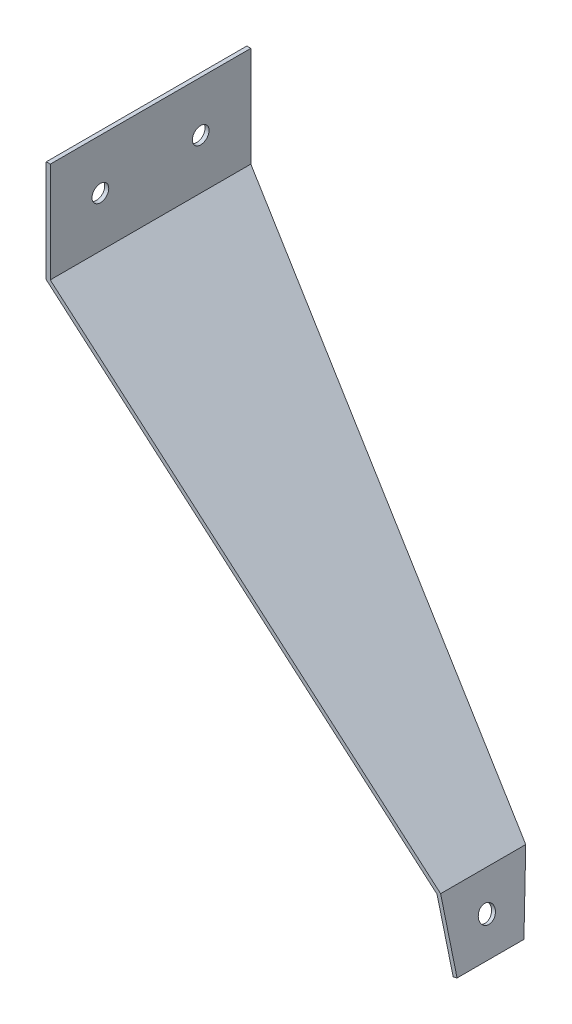
ISO-10303-21;
HEADER;
FILE_DESCRIPTION(('STEP AP214'),'2;1');
FILE_NAME('part.step','',(''),(''),'','','');
FILE_SCHEMA(('AUTOMOTIVE_DESIGN { 1 0 10303 214 1 1 1 1 }'));
ENDSEC;
DATA;
#1=APPLICATION_CONTEXT('core data for automotive mechanical design processes');
#2=APPLICATION_PROTOCOL_DEFINITION('international standard','automotive_design',2000,#1);
#3=PRODUCT_CONTEXT('',#1,'mechanical');
#4=PRODUCT('Part','Part','',(#3));
#5=PRODUCT_RELATED_PRODUCT_CATEGORY('part','',(#4));
#6=PRODUCT_DEFINITION_FORMATION('','',#4);
#7=PRODUCT_DEFINITION_CONTEXT('part definition',#1,'design');
#8=PRODUCT_DEFINITION('design','',#6,#7);
#9=PRODUCT_DEFINITION_SHAPE('','',#8);
#10=(LENGTH_UNIT() NAMED_UNIT(*) SI_UNIT(.MILLI.,.METRE.));
#11=(NAMED_UNIT(*) PLANE_ANGLE_UNIT() SI_UNIT($,.RADIAN.));
#12=(NAMED_UNIT(*) SI_UNIT($,.STERADIAN.) SOLID_ANGLE_UNIT());
#13=UNCERTAINTY_MEASURE_WITH_UNIT(LENGTH_MEASURE(1.E-05),#10,'distance_accuracy_value','');
#14=(GEOMETRIC_REPRESENTATION_CONTEXT(3) GLOBAL_UNCERTAINTY_ASSIGNED_CONTEXT((#13)) GLOBAL_UNIT_ASSIGNED_CONTEXT((#10,
#11,#12)) REPRESENTATION_CONTEXT('',''));
#15=CARTESIAN_POINT('',(0.,0.,0.));
#16=DIRECTION('',(0.,0.,1.));
#17=DIRECTION('',(1.,0.,0.));
#18=AXIS2_PLACEMENT_3D('',#15,#16,#17);
#19=CARTESIAN_POINT('',(0.,0.,-76.2));
#20=DIRECTION('',(0.652759752462726,0.757564984384047,0.));
#21=DIRECTION('',(-0.757564984384047,0.652759752462726,0.));
#22=AXIS2_PLACEMENT_3D('',#19,#20,#21);
#23=PLANE('',#22);
#24=DIRECTION('',(0.739242312652907,-0.636971928434139,0.218603672362739));
#25=VECTOR('',#24,1.);
#26=CARTESIAN_POINT('',(0.,0.,-76.2));
#27=LINE('',#26,#25);
#28=CARTESIAN_POINT('',(0.,1.14491749414469E-13,-76.2));
#29=VERTEX_POINT('',#28);
#30=CARTESIAN_POINT('',(148.297771302394,-127.781534893449,-32.346399015536));
#31=VERTEX_POINT('',#30);
#32=EDGE_CURVE('E124',#29,#31,#27,.T.);
#33=ORIENTED_EDGE('',*,*,#32,.F.);
#34=DIRECTION('',(0.,0.,1.));
#35=VECTOR('',#34,1.);
#36=CARTESIAN_POINT('',(0.,0.,-76.2));
#37=LINE('',#36,#35);
#38=CARTESIAN_POINT('',(0.,0.,0.));
#39=VERTEX_POINT('',#38);
#40=EDGE_CURVE('E118',#29,#39,#37,.T.);
#41=ORIENTED_EDGE('',*,*,#40,.T.);
#42=DIRECTION('',(-0.757564984384047,0.652759752462726,0.));
#43=VECTOR('',#42,1.);
#44=CARTESIAN_POINT('',(0.,0.,0.));
#45=LINE('',#44,#43);
#46=CARTESIAN_POINT('',(148.297771302394,-127.781534893448,0.));
#47=VERTEX_POINT('',#46);
#48=EDGE_CURVE('E116',#47,#39,#45,.T.);
#49=ORIENTED_EDGE('',*,*,#48,.F.);
#50=DIRECTION('',(0.,0.,1.));
#51=VECTOR('',#50,1.);
#52=CARTESIAN_POINT('',(148.297771302394,-127.781534893448,-76.2));
#53=LINE('',#52,#51);
#54=EDGE_CURVE('E55',#31,#47,#53,.T.);
#55=ORIENTED_EDGE('',*,*,#54,.F.);
#56=EDGE_LOOP('',(#33,#41,#49,#55));
#57=FACE_BOUND('',#56,.T.);
#58=ADVANCED_FACE('F46',(#57),#23,.T.);
#59=CARTESIAN_POINT('',(148.297771302394,-127.781534893448,-76.2));
#60=DIRECTION('',(0.969230909706754,0.246153293028995,0.));
#61=DIRECTION('',(-0.246153293028995,0.969230909706754,0.));
#62=AXIS2_PLACEMENT_3D('',#59,#60,#61);
#63=PLANE('',#62);
#64=CARTESIAN_POINT('',(151.423918123862,-140.090767446724,-14.436599753884));
#65=DIRECTION('',(0.969230909706754,0.246153293028994,0.));
#66=DIRECTION('',(-0.246153293028994,0.969230909706754,0.));
#67=AXIS2_PLACEMENT_3D('',#64,#65,#66);
#68=CIRCLE('',#67,3.175);
#69=CARTESIAN_POINT('',(150.642381418495,-137.013459308405,-14.436599753884));
#70=VERTEX_POINT('',#69);
#71=EDGE_CURVE('E157',#70,#70,#68,.T.);
#72=ORIENTED_EDGE('',*,*,#71,.F.);
#73=EDGE_LOOP('',(#72));
#74=FACE_BOUND('',#73,.T.);
#75=DIRECTION('',(0.237434348415612,-0.934899983171816,0.263793388199537));
#76=VECTOR('',#75,1.);
#77=CARTESIAN_POINT('',(154.550064945331,-152.4,-25.4));
#78=LINE('',#77,#76);
#79=CARTESIAN_POINT('',(154.550064945331,-152.4,-25.4));
#80=VERTEX_POINT('',#79);
#81=EDGE_CURVE('E109',#31,#80,#78,.T.);
#82=ORIENTED_EDGE('',*,*,#81,.F.);
#83=ORIENTED_EDGE('',*,*,#54,.T.);
#84=DIRECTION('',(-0.246153293028995,0.969230909706754,0.));
#85=VECTOR('',#84,1.);
#86=CARTESIAN_POINT('',(148.297771302394,-127.781534893448,0.));
#87=LINE('',#86,#85);
#88=CARTESIAN_POINT('',(154.550064945331,-152.4,0.));
#89=VERTEX_POINT('',#88);
#90=EDGE_CURVE('E106',#89,#47,#87,.T.);
#91=ORIENTED_EDGE('',*,*,#90,.F.);
#92=DIRECTION('',(0.,0.,1.));
#93=VECTOR('',#92,1.);
#94=CARTESIAN_POINT('',(154.550064945331,-152.4,-76.2));
#95=LINE('',#94,#93);
#96=EDGE_CURVE('E113',#80,#89,#95,.T.);
#97=ORIENTED_EDGE('',*,*,#96,.F.);
#98=EDGE_LOOP('',(#82,#83,#91,#97));
#99=FACE_BOUND('',#98,.T.);
#100=ADVANCED_FACE('F103',(#74,#99),#63,.T.);
#101=CARTESIAN_POINT('',(153.072957038938,-152.775137618576,-76.2));
#102=DIRECTION('',(0.246153293028989,-0.969230909706756,0.));
#103=DIRECTION('',(0.969230909706756,0.246153293028989,0.));
#104=AXIS2_PLACEMENT_3D('',#101,#102,#103);
#105=PLANE('',#104);
#106=DIRECTION('',(0.969230909706754,0.246153293028994,0.));
#107=VECTOR('',#106,1.);
#108=CARTESIAN_POINT('',(7.84325281382631,-189.65878379888,-25.4));
#109=LINE('',#108,#107);
#110=CARTESIAN_POINT('',(153.072957038938,-152.775137618576,-25.4));
#111=VERTEX_POINT('',#110);
#112=EDGE_CURVE('E165',#111,#80,#109,.T.);
#113=ORIENTED_EDGE('',*,*,#112,.T.);
#114=ORIENTED_EDGE('',*,*,#96,.T.);
#115=DIRECTION('',(0.969230909706755,0.246153293028988,0.));
#116=VECTOR('',#115,1.);
#117=CARTESIAN_POINT('',(153.072957038938,-152.775137618576,0.));
#118=LINE('',#117,#116);
#119=CARTESIAN_POINT('',(153.072957038938,-152.775137618576,0.));
#120=VERTEX_POINT('',#119);
#121=EDGE_CURVE('E130',#120,#89,#118,.T.);
#122=ORIENTED_EDGE('',*,*,#121,.F.);
#123=DIRECTION('',(0.,0.,1.));
#124=VECTOR('',#123,1.);
#125=CARTESIAN_POINT('',(153.072957038938,-152.775137618576,-76.2));
#126=LINE('',#125,#124);
#127=EDGE_CURVE('E209',#111,#120,#126,.T.);
#128=ORIENTED_EDGE('',*,*,#127,.F.);
#129=EDGE_LOOP('',(#113,#114,#122,#128));
#130=FACE_BOUND('',#129,.T.);
#131=ADVANCED_FACE('F213',(#130),#105,.T.);
#132=CARTESIAN_POINT('',(146.938943832801,-128.622402845954,-76.2));
#133=DIRECTION('',(-0.969230909706754,-0.246153293028994,0.));
#134=DIRECTION('',(0.246153293028994,-0.969230909706754,0.));
#135=AXIS2_PLACEMENT_3D('',#132,#133,#134);
#136=PLANE('',#135);
#137=CARTESIAN_POINT('',(149.946810217469,-140.4659050653,-14.436599753884));
#138=DIRECTION('',(-0.969230909706754,-0.246153293028994,0.));
#139=DIRECTION('',(0.246153293028994,-0.969230909706754,0.));
#140=AXIS2_PLACEMENT_3D('',#137,#138,#139);
#141=CIRCLE('',#140,3.175);
#142=CARTESIAN_POINT('',(150.728346922836,-143.543213203619,-14.436599753884));
#143=VERTEX_POINT('',#142);
#144=EDGE_CURVE('E49',#143,#143,#141,.T.);
#145=ORIENTED_EDGE('',*,*,#144,.F.);
#146=EDGE_LOOP('',(#145));
#147=FACE_BOUND('',#146,.T.);
#148=DIRECTION('',(-0.237434348415611,0.934899983171817,-0.263793388199537));
#149=VECTOR('',#148,1.);
#150=CARTESIAN_POINT('',(144.184003662075,-117.7747999762,-35.2757704791972));
#151=LINE('',#150,#149);
#152=CARTESIAN_POINT('',(146.938943832801,-128.622402845954,-32.2149875437358));
#153=VERTEX_POINT('',#152);
#154=EDGE_CURVE('E174',#111,#153,#151,.T.);
#155=ORIENTED_EDGE('',*,*,#154,.F.);
#156=ORIENTED_EDGE('',*,*,#127,.T.);
#157=DIRECTION('',(0.246153293028994,-0.969230909706754,0.));
#158=VECTOR('',#157,1.);
#159=CARTESIAN_POINT('',(146.938943832801,-128.622402845954,0.));
#160=LINE('',#159,#158);
#161=CARTESIAN_POINT('',(146.938943832801,-128.622402845954,0.));
#162=VERTEX_POINT('',#161);
#163=EDGE_CURVE('E139',#162,#120,#160,.T.);
#164=ORIENTED_EDGE('',*,*,#163,.F.);
#165=DIRECTION('',(0.,0.,1.));
#166=VECTOR('',#165,1.);
#167=CARTESIAN_POINT('',(146.938943832801,-128.622402845954,-76.2));
#168=LINE('',#167,#166);
#169=EDGE_CURVE('E207',#153,#162,#168,.T.);
#170=ORIENTED_EDGE('',*,*,#169,.F.);
#171=EDGE_LOOP('',(#155,#156,#164,#170));
#172=FACE_BOUND('',#171,.T.);
#173=ADVANCED_FACE('F206',(#147,#172),#136,.T.);
#174=CARTESIAN_POINT('',(-1.524,-0.698546194920925,-76.2));
#175=DIRECTION('',(-0.652759752462726,-0.757564984384046,0.));
#176=DIRECTION('',(0.757564984384046,-0.652759752462726,0.));
#177=AXIS2_PLACEMENT_3D('',#174,#175,#176);
#178=PLANE('',#177);
#179=DIRECTION('',(-0.739242312652907,0.636971928434139,-0.218603672362739));
#180=VECTOR('',#179,1.);
#181=CARTESIAN_POINT('',(-1.53734304320666,-0.687049093338597,-76.1213779306704));
#182=LINE('',#181,#180);
#183=CARTESIAN_POINT('',(-1.524,-0.698546194920925,-76.1174322173426));
#184=VERTEX_POINT('',#183);
#185=EDGE_CURVE('E171',#153,#184,#182,.T.);
#186=ORIENTED_EDGE('',*,*,#185,.F.);
#187=ORIENTED_EDGE('',*,*,#169,.T.);
#188=DIRECTION('',(0.757564984384046,-0.652759752462726,0.));
#189=VECTOR('',#188,1.);
#190=CARTESIAN_POINT('',(-1.524,-0.698546194920925,0.));
#191=LINE('',#190,#189);
#192=CARTESIAN_POINT('',(-1.524,-0.698546194920925,0.));
#193=VERTEX_POINT('',#192);
#194=EDGE_CURVE('E197',#193,#162,#191,.T.);
#195=ORIENTED_EDGE('',*,*,#194,.F.);
#196=DIRECTION('',(0.,0.,1.));
#197=VECTOR('',#196,1.);
#198=CARTESIAN_POINT('',(-1.524,-0.698546194920925,-76.2));
#199=LINE('',#198,#197);
#200=EDGE_CURVE('E219',#184,#193,#199,.T.);
#201=ORIENTED_EDGE('',*,*,#200,.F.);
#202=EDGE_LOOP('',(#186,#187,#195,#201));
#203=FACE_BOUND('',#202,.T.);
#204=ADVANCED_FACE('F266',(#203),#178,.T.);
#205=CARTESIAN_POINT('',(-1.524,-0.698546194920925,-76.2));
#206=DIRECTION('',(-1.,0.,0.));
#207=DIRECTION('',(0.,0.,1.));
#208=AXIS2_PLACEMENT_3D('',#205,#206,#207);
#209=PLANE('',#208);
#210=CARTESIAN_POINT('',(-1.52400000000003,19.05,-19.05));
#211=DIRECTION('',(1.,0.,0.));
#212=DIRECTION('',(0.,0.,-1.));
#213=AXIS2_PLACEMENT_3D('',#210,#211,#212);
#214=CIRCLE('',#213,3.175);
#215=CARTESIAN_POINT('',(-1.52400000000003,19.05,-22.225));
#216=VERTEX_POINT('',#215);
#217=EDGE_CURVE('E162',#216,#216,#214,.T.);
#218=ORIENTED_EDGE('',*,*,#217,.T.);
#219=EDGE_LOOP('',(#218));
#220=FACE_BOUND('',#219,.T.);
#221=CARTESIAN_POINT('',(-1.52400000000003,19.05,-57.15));
#222=DIRECTION('',(1.,0.,0.));
#223=DIRECTION('',(0.,0.,-1.));
#224=AXIS2_PLACEMENT_3D('',#221,#222,#223);
#225=CIRCLE('',#224,3.175);
#226=CARTESIAN_POINT('',(-1.52400000000003,19.05,-60.325));
#227=VERTEX_POINT('',#226);
#228=EDGE_CURVE('E155',#227,#227,#225,.T.);
#229=ORIENTED_EDGE('',*,*,#228,.T.);
#230=EDGE_LOOP('',(#229));
#231=FACE_BOUND('',#230,.T.);
#232=DIRECTION('',(0.,0.966619174412419,-0.256217430434102));
#233=VECTOR('',#232,1.);
#234=CARTESIAN_POINT('',(-1.524,-0.678097071361907,-76.1228525752577));
#235=LINE('',#234,#233);
#236=CARTESIAN_POINT('',(-1.524,-0.387046693227816,-76.2));
#237=VERTEX_POINT('',#236);
#238=EDGE_CURVE('E62',#184,#237,#235,.T.);
#239=ORIENTED_EDGE('',*,*,#238,.F.);
#240=ORIENTED_EDGE('',*,*,#200,.T.);
#241=DIRECTION('',(0.,-1.,0.));
#242=VECTOR('',#241,1.);
#243=CARTESIAN_POINT('',(-1.524,-0.698546194920925,0.));
#244=LINE('',#243,#242);
#245=CARTESIAN_POINT('',(-1.524,38.1,0.));
#246=VERTEX_POINT('',#245);
#247=EDGE_CURVE('E193',#246,#193,#244,.T.);
#248=ORIENTED_EDGE('',*,*,#247,.F.);
#249=DIRECTION('',(0.,0.,1.));
#250=VECTOR('',#249,1.);
#251=CARTESIAN_POINT('',(-1.524,38.1,-76.2));
#252=LINE('',#251,#250);
#253=CARTESIAN_POINT('',(-1.524,38.1,-76.2));
#254=VERTEX_POINT('',#253);
#255=EDGE_CURVE('E70',#254,#246,#252,.T.);
#256=ORIENTED_EDGE('',*,*,#255,.F.);
#257=DIRECTION('',(0.,-1.,0.));
#258=VECTOR('',#257,1.);
#259=CARTESIAN_POINT('',(-1.524,-0.698546194920925,-76.2));
#260=LINE('',#259,#258);
#261=EDGE_CURVE('E184',#254,#237,#260,.T.);
#262=ORIENTED_EDGE('',*,*,#261,.T.);
#263=EDGE_LOOP('',(#239,#240,#248,#256,#262));
#264=FACE_BOUND('',#263,.T.);
#265=ADVANCED_FACE('F240',(#220,#231,#264),#209,.T.);
#266=CARTESIAN_POINT('',(-1.524,38.1,-76.2));
#267=DIRECTION('',(0.,1.,0.));
#268=DIRECTION('',(0.,0.,1.));
#269=AXIS2_PLACEMENT_3D('',#266,#267,#268);
#270=PLANE('',#269);
#271=DIRECTION('',(-1.,0.,0.));
#272=VECTOR('',#271,1.);
#273=CARTESIAN_POINT('',(-1.524,38.1,0.));
#274=LINE('',#273,#272);
#275=CARTESIAN_POINT('',(0.,38.1,0.));
#276=VERTEX_POINT('',#275);
#277=EDGE_CURVE('E189',#276,#246,#274,.T.);
#278=ORIENTED_EDGE('',*,*,#277,.F.);
#279=DIRECTION('',(0.,0.,1.));
#280=VECTOR('',#279,1.);
#281=CARTESIAN_POINT('',(0.,38.1,-76.2));
#282=LINE('',#281,#280);
#283=CARTESIAN_POINT('',(0.,38.1,-76.2));
#284=VERTEX_POINT('',#283);
#285=EDGE_CURVE('E224',#284,#276,#282,.T.);
#286=ORIENTED_EDGE('',*,*,#285,.F.);
#287=DIRECTION('',(-1.,0.,0.));
#288=VECTOR('',#287,1.);
#289=CARTESIAN_POINT('',(-1.524,38.1,-76.2));
#290=LINE('',#289,#288);
#291=EDGE_CURVE('E137',#284,#254,#290,.T.);
#292=ORIENTED_EDGE('',*,*,#291,.T.);
#293=ORIENTED_EDGE('',*,*,#255,.T.);
#294=EDGE_LOOP('',(#278,#286,#292,#293));
#295=FACE_BOUND('',#294,.T.);
#296=ADVANCED_FACE('F254',(#295),#270,.T.);
#297=CARTESIAN_POINT('',(0.,0.,-76.2));
#298=DIRECTION('',(1.,0.,0.));
#299=DIRECTION('',(0.,0.,-1.));
#300=AXIS2_PLACEMENT_3D('',#297,#298,#299);
#301=PLANE('',#300);
#302=CARTESIAN_POINT('',(0.,19.05,-19.05));
#303=DIRECTION('',(1.,0.,0.));
#304=DIRECTION('',(0.,0.,-1.));
#305=AXIS2_PLACEMENT_3D('',#302,#303,#304);
#306=CIRCLE('',#305,3.175);
#307=CARTESIAN_POINT('',(0.,19.05,-22.225));
#308=VERTEX_POINT('',#307);
#309=EDGE_CURVE('E231',#308,#308,#306,.T.);
#310=ORIENTED_EDGE('',*,*,#309,.F.);
#311=EDGE_LOOP('',(#310));
#312=FACE_BOUND('',#311,.T.);
#313=CARTESIAN_POINT('',(0.,19.05,-57.15));
#314=DIRECTION('',(1.,0.,0.));
#315=DIRECTION('',(0.,0.,-1.));
#316=AXIS2_PLACEMENT_3D('',#313,#314,#315);
#317=CIRCLE('',#316,3.175);
#318=CARTESIAN_POINT('',(0.,19.05,-60.325));
#319=VERTEX_POINT('',#318);
#320=EDGE_CURVE('E150',#319,#319,#317,.T.);
#321=ORIENTED_EDGE('',*,*,#320,.F.);
#322=EDGE_LOOP('',(#321));
#323=FACE_BOUND('',#322,.T.);
#324=DIRECTION('',(0.,1.,0.));
#325=VECTOR('',#324,1.);
#326=CARTESIAN_POINT('',(0.,0.,0.));
#327=LINE('',#326,#325);
#328=EDGE_CURVE('E123',#39,#276,#327,.T.);
#329=ORIENTED_EDGE('',*,*,#328,.F.);
#330=ORIENTED_EDGE('',*,*,#40,.F.);
#331=DIRECTION('',(0.,1.,0.));
#332=VECTOR('',#331,1.);
#333=CARTESIAN_POINT('',(0.,0.,-76.2));
#334=LINE('',#333,#332);
#335=EDGE_CURVE('E132',#29,#284,#334,.T.);
#336=ORIENTED_EDGE('',*,*,#335,.T.);
#337=ORIENTED_EDGE('',*,*,#285,.T.);
#338=EDGE_LOOP('',(#329,#330,#336,#337));
#339=FACE_BOUND('',#338,.T.);
#340=ADVANCED_FACE('F250',(#312,#323,#339),#301,.T.);
#341=CARTESIAN_POINT('',(0.,0.,-76.2));
#342=DIRECTION('',(0.,0.,1.));
#343=DIRECTION('',(1.,0.,0.));
#344=AXIS2_PLACEMENT_3D('',#341,#342,#343);
#345=PLANE('',#344);
#346=ORIENTED_EDGE('',*,*,#335,.F.);
#347=DIRECTION('',(-0.969230909706754,-0.246153293028994,0.));
#348=VECTOR('',#347,1.);
#349=CARTESIAN_POINT('',(0.,0.,-76.2));
#350=LINE('',#349,#348);
#351=EDGE_CURVE('E12',#29,#237,#350,.T.);
#352=ORIENTED_EDGE('',*,*,#351,.T.);
#353=ORIENTED_EDGE('',*,*,#261,.F.);
#354=ORIENTED_EDGE('',*,*,#291,.F.);
#355=EDGE_LOOP('',(#346,#352,#353,#354));
#356=FACE_BOUND('',#355,.T.);
#357=ADVANCED_FACE('F253',(#356),#345,.F.);
#358=CARTESIAN_POINT('',(0.,0.,0.));
#359=DIRECTION('',(0.,0.,1.));
#360=DIRECTION('',(1.,0.,0.));
#361=AXIS2_PLACEMENT_3D('',#358,#359,#360);
#362=PLANE('',#361);
#363=ORIENTED_EDGE('',*,*,#48,.T.);
#364=ORIENTED_EDGE('',*,*,#328,.T.);
#365=ORIENTED_EDGE('',*,*,#277,.T.);
#366=ORIENTED_EDGE('',*,*,#247,.T.);
#367=ORIENTED_EDGE('',*,*,#194,.T.);
#368=ORIENTED_EDGE('',*,*,#163,.T.);
#369=ORIENTED_EDGE('',*,*,#121,.T.);
#370=ORIENTED_EDGE('',*,*,#90,.T.);
#371=EDGE_LOOP('',(#363,#364,#365,#366,#367,#368,#369,#370));
#372=FACE_BOUND('',#371,.T.);
#373=ADVANCED_FACE('F127',(#372),#362,.T.);
#374=CARTESIAN_POINT('',(7.84325281382631,-189.65878379888,-25.4));
#375=DIRECTION('',(-0.0649336111845917,0.255676705619264,0.964579207915145));
#376=DIRECTION('',(0.,-0.966619174412419,0.256217430434102));
#377=AXIS2_PLACEMENT_3D('',#374,#375,#376);
#378=PLANE('',#377);
#379=ORIENTED_EDGE('',*,*,#32,.T.);
#380=ORIENTED_EDGE('',*,*,#81,.T.);
#381=ORIENTED_EDGE('',*,*,#112,.F.);
#382=ORIENTED_EDGE('',*,*,#154,.T.);
#383=ORIENTED_EDGE('',*,*,#185,.T.);
#384=ORIENTED_EDGE('',*,*,#238,.T.);
#385=ORIENTED_EDGE('',*,*,#351,.F.);
#386=EDGE_LOOP('',(#379,#380,#381,#382,#383,#384,#385));
#387=FACE_BOUND('',#386,.T.);
#388=ADVANCED_FACE('F267',(#387),#378,.F.);
#389=CARTESIAN_POINT('',(4.71710599235811,-177.349551245604,-14.436599753884));
#390=DIRECTION('',(0.969230909706754,0.246153293028994,0.));
#391=DIRECTION('',(-0.246153293028994,0.969230909706754,0.));
#392=AXIS2_PLACEMENT_3D('',#389,#390,#391);
#393=CYLINDRICAL_SURFACE('',#392,3.175);
#394=ORIENTED_EDGE('',*,*,#144,.T.);
#395=EDGE_LOOP('',(#394));
#396=FACE_BOUND('',#395,.T.);
#397=ORIENTED_EDGE('',*,*,#71,.T.);
#398=EDGE_LOOP('',(#397));
#399=FACE_BOUND('',#398,.T.);
#400=ADVANCED_FACE('F324',(#396,#399),#393,.F.);
#401=CARTESIAN_POINT('',(-1.52400000000003,19.05,-57.15));
#402=DIRECTION('',(1.,0.,0.));
#403=DIRECTION('',(0.,0.,-1.));
#404=AXIS2_PLACEMENT_3D('',#401,#402,#403);
#405=CYLINDRICAL_SURFACE('',#404,3.175);
#406=ORIENTED_EDGE('',*,*,#228,.F.);
#407=EDGE_LOOP('',(#406));
#408=FACE_BOUND('',#407,.T.);
#409=ORIENTED_EDGE('',*,*,#320,.T.);
#410=EDGE_LOOP('',(#409));
#411=FACE_BOUND('',#410,.T.);
#412=ADVANCED_FACE('F246',(#408,#411),#405,.F.);
#413=CARTESIAN_POINT('',(-1.52400000000003,19.05,-19.05));
#414=DIRECTION('',(1.,0.,0.));
#415=DIRECTION('',(0.,0.,-1.));
#416=AXIS2_PLACEMENT_3D('',#413,#414,#415);
#417=CYLINDRICAL_SURFACE('',#416,3.175);
#418=ORIENTED_EDGE('',*,*,#217,.F.);
#419=EDGE_LOOP('',(#418));
#420=FACE_BOUND('',#419,.T.);
#421=ORIENTED_EDGE('',*,*,#309,.T.);
#422=EDGE_LOOP('',(#421));
#423=FACE_BOUND('',#422,.T.);
#424=ADVANCED_FACE('F243',(#420,#423),#417,.F.);
#425=CLOSED_SHELL('',(#58,#100,#131,#173,#204,#265,#296,#340,#357,#373,#388,#400,#412,#424));
#426=MANIFOLD_SOLID_BREP('B2',#425);
#427=ADVANCED_BREP_SHAPE_REPRESENTATION('',(#18,#426),#14);
#428=SHAPE_DEFINITION_REPRESENTATION(#9,#427);
ENDSEC;
END-ISO-10303-21;
